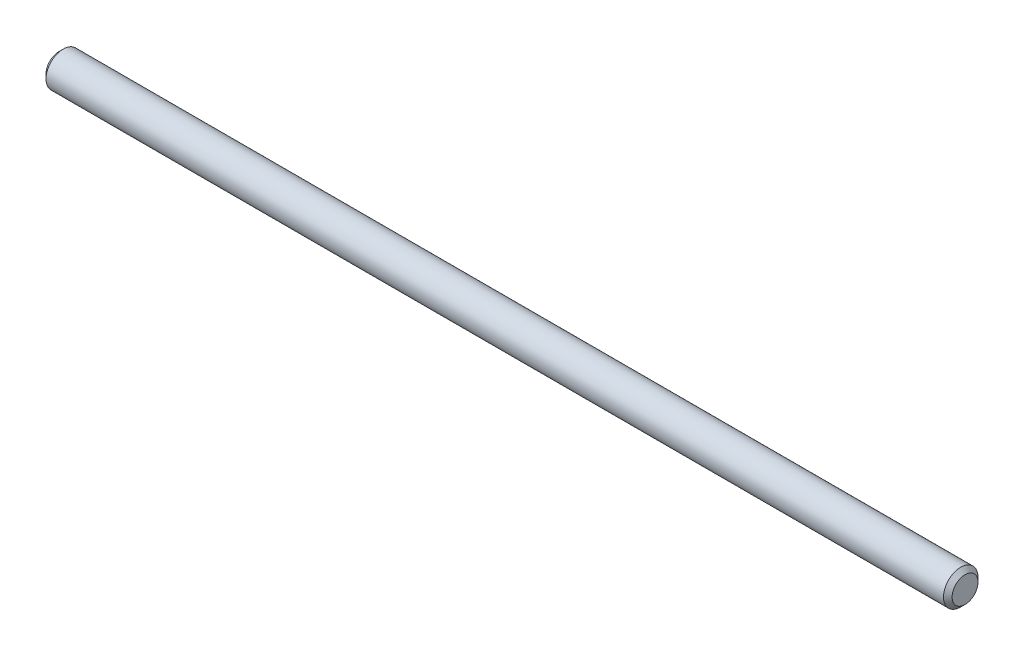
ISO-10303-21;
HEADER;
FILE_DESCRIPTION(('STEP AP214'),'2;1');
FILE_NAME('part.step','',(''),(''),'','','');
FILE_SCHEMA(('AUTOMOTIVE_DESIGN { 1 0 10303 214 1 1 1 1 }'));
ENDSEC;
DATA;
#1=APPLICATION_CONTEXT('core data for automotive mechanical design processes');
#2=APPLICATION_PROTOCOL_DEFINITION('international standard','automotive_design',2000,#1);
#3=PRODUCT_CONTEXT('',#1,'mechanical');
#4=PRODUCT('Part','Part','',(#3));
#5=PRODUCT_RELATED_PRODUCT_CATEGORY('part','',(#4));
#6=PRODUCT_DEFINITION_FORMATION('','',#4);
#7=PRODUCT_DEFINITION_CONTEXT('part definition',#1,'design');
#8=PRODUCT_DEFINITION('design','',#6,#7);
#9=PRODUCT_DEFINITION_SHAPE('','',#8);
#10=(LENGTH_UNIT() NAMED_UNIT(*) SI_UNIT(.MILLI.,.METRE.));
#11=(NAMED_UNIT(*) PLANE_ANGLE_UNIT() SI_UNIT($,.RADIAN.));
#12=(NAMED_UNIT(*) SI_UNIT($,.STERADIAN.) SOLID_ANGLE_UNIT());
#13=UNCERTAINTY_MEASURE_WITH_UNIT(LENGTH_MEASURE(1.E-05),#10,'distance_accuracy_value','');
#14=(GEOMETRIC_REPRESENTATION_CONTEXT(3) GLOBAL_UNCERTAINTY_ASSIGNED_CONTEXT((#13)) GLOBAL_UNIT_ASSIGNED_CONTEXT((#10,
#11,#12)) REPRESENTATION_CONTEXT('',''));
#15=CARTESIAN_POINT('',(0.,0.,0.));
#16=DIRECTION('',(0.,0.,1.));
#17=DIRECTION('',(1.,0.,0.));
#18=AXIS2_PLACEMENT_3D('',#15,#16,#17);
#19=CARTESIAN_POINT('',(105.,0.,0.));
#20=DIRECTION('',(-1.,0.,0.));
#21=DIRECTION('',(0.,0.,1.));
#22=AXIS2_PLACEMENT_3D('',#19,#20,#21);
#23=CYLINDRICAL_SURFACE('',#22,2.);
#24=CARTESIAN_POINT('',(104.5,0.,0.));
#25=DIRECTION('',(1.,0.,0.));
#26=DIRECTION('',(0.,0.,-1.));
#27=AXIS2_PLACEMENT_3D('',#24,#25,#26);
#28=CIRCLE('',#27,2.);
#29=CARTESIAN_POINT('',(104.5,0.,-2.));
#30=VERTEX_POINT('',#29);
#31=EDGE_CURVE('E10',#30,#30,#28,.F.);
#32=ORIENTED_EDGE('',*,*,#31,.T.);
#33=EDGE_LOOP('',(#32));
#34=FACE_BOUND('',#33,.T.);
#35=CARTESIAN_POINT('',(0.499999999999973,0.,0.));
#36=DIRECTION('',(1.,0.,0.));
#37=DIRECTION('',(0.,0.,-1.));
#38=AXIS2_PLACEMENT_3D('',#35,#36,#37);
#39=CIRCLE('',#38,2.);
#40=CARTESIAN_POINT('',(0.499999999999973,0.,-2.));
#41=VERTEX_POINT('',#40);
#42=EDGE_CURVE('E66',#41,#41,#39,.T.);
#43=ORIENTED_EDGE('',*,*,#42,.T.);
#44=EDGE_LOOP('',(#43));
#45=FACE_BOUND('',#44,.T.);
#46=ADVANCED_FACE('F47',(#34,#45),#23,.T.);
#47=CARTESIAN_POINT('',(105.,0.,0.));
#48=DIRECTION('',(1.,0.,0.));
#49=DIRECTION('',(0.,0.,-1.));
#50=AXIS2_PLACEMENT_3D('',#47,#48,#49);
#51=PLANE('',#50);
#52=CARTESIAN_POINT('',(105.,0.,0.));
#53=DIRECTION('',(1.,0.,0.));
#54=DIRECTION('',(0.,0.,-1.));
#55=AXIS2_PLACEMENT_3D('',#52,#53,#54);
#56=CIRCLE('',#55,1.5);
#57=CARTESIAN_POINT('',(105.,0.,-1.5));
#58=VERTEX_POINT('',#57);
#59=EDGE_CURVE('E56',#58,#58,#56,.T.);
#60=ORIENTED_EDGE('',*,*,#59,.T.);
#61=EDGE_LOOP('',(#60));
#62=FACE_BOUND('',#61,.T.);
#63=ADVANCED_FACE('F83',(#62),#51,.T.);
#64=CARTESIAN_POINT('',(0.,0.,0.));
#65=DIRECTION('',(1.,0.,0.));
#66=DIRECTION('',(0.,0.,-1.));
#67=AXIS2_PLACEMENT_3D('',#64,#65,#66);
#68=PLANE('',#67);
#69=CARTESIAN_POINT('',(0.,0.,0.));
#70=DIRECTION('',(1.,0.,0.));
#71=DIRECTION('',(0.,0.,-1.));
#72=AXIS2_PLACEMENT_3D('',#69,#70,#71);
#73=CIRCLE('',#72,1.50000000000002);
#74=CARTESIAN_POINT('',(0.,0.,-1.50000000000002));
#75=VERTEX_POINT('',#74);
#76=EDGE_CURVE('E61',#75,#75,#73,.F.);
#77=ORIENTED_EDGE('',*,*,#76,.T.);
#78=EDGE_LOOP('',(#77));
#79=FACE_BOUND('',#78,.T.);
#80=ADVANCED_FACE('F76',(#79),#68,.F.);
#81=CARTESIAN_POINT('',(0.499999999999973,0.,0.));
#82=DIRECTION('',(1.,0.,0.));
#83=DIRECTION('',(0.,0.,-1.));
#84=AXIS2_PLACEMENT_3D('',#81,#82,#83);
#85=CONICAL_SURFACE('',#84,2.,0.78539816339746);
#86=ORIENTED_EDGE('',*,*,#76,.F.);
#87=EDGE_LOOP('',(#86));
#88=FACE_BOUND('',#87,.T.);
#89=ORIENTED_EDGE('',*,*,#42,.F.);
#90=EDGE_LOOP('',(#89));
#91=FACE_BOUND('',#90,.T.);
#92=ADVANCED_FACE('F74',(#88,#91),#85,.T.);
#93=CARTESIAN_POINT('',(105.,0.,0.));
#94=DIRECTION('',(-1.,0.,0.));
#95=DIRECTION('',(0.,0.,1.));
#96=AXIS2_PLACEMENT_3D('',#93,#94,#95);
#97=CONICAL_SURFACE('',#96,1.5,0.78539816339746);
#98=ORIENTED_EDGE('',*,*,#31,.F.);
#99=EDGE_LOOP('',(#98));
#100=FACE_BOUND('',#99,.T.);
#101=ORIENTED_EDGE('',*,*,#59,.F.);
#102=EDGE_LOOP('',(#101));
#103=FACE_BOUND('',#102,.T.);
#104=ADVANCED_FACE('F50',(#100,#103),#97,.T.);
#105=CLOSED_SHELL('',(#46,#63,#80,#92,#104));
#106=MANIFOLD_SOLID_BREP('B2',#105);
#107=ADVANCED_BREP_SHAPE_REPRESENTATION('',(#18,#106),#14);
#108=SHAPE_DEFINITION_REPRESENTATION(#9,#107);
ENDSEC;
END-ISO-10303-21;
